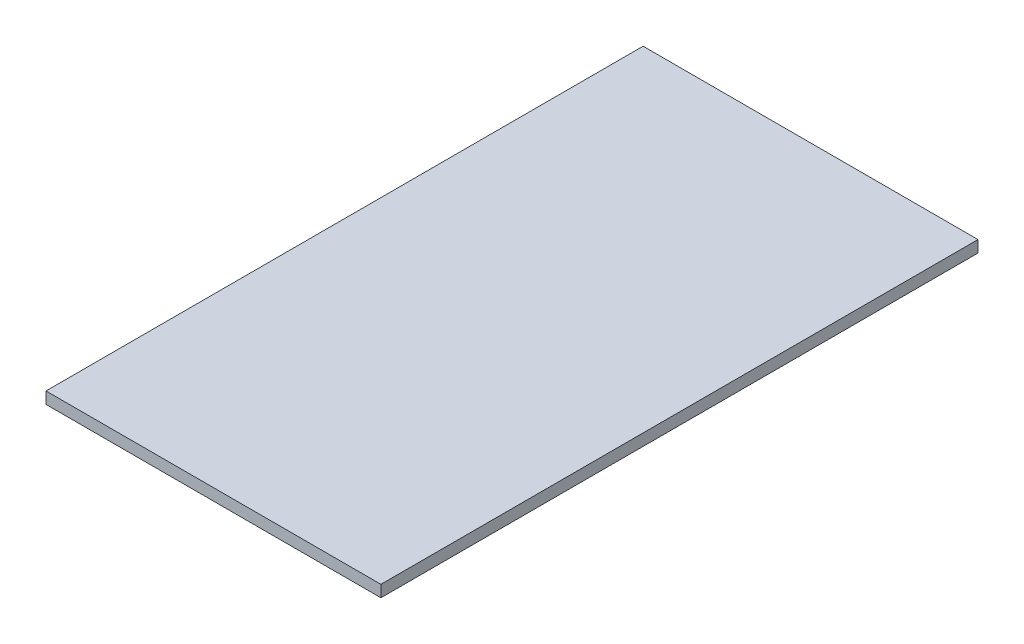
ISO-10303-21;
HEADER;
FILE_DESCRIPTION(('STEP AP214'),'2;1');
FILE_NAME('part.step','',(''),(''),'','','');
FILE_SCHEMA(('AUTOMOTIVE_DESIGN { 1 0 10303 214 1 1 1 1 }'));
ENDSEC;
DATA;
#1=APPLICATION_CONTEXT('core data for automotive mechanical design processes');
#2=APPLICATION_PROTOCOL_DEFINITION('international standard','automotive_design',2000,#1);
#3=PRODUCT_CONTEXT('',#1,'mechanical');
#4=PRODUCT('Part','Part','',(#3));
#5=PRODUCT_RELATED_PRODUCT_CATEGORY('part','',(#4));
#6=PRODUCT_DEFINITION_FORMATION('','',#4);
#7=PRODUCT_DEFINITION_CONTEXT('part definition',#1,'design');
#8=PRODUCT_DEFINITION('design','',#6,#7);
#9=PRODUCT_DEFINITION_SHAPE('','',#8);
#10=(LENGTH_UNIT() NAMED_UNIT(*) SI_UNIT(.MILLI.,.METRE.));
#11=(NAMED_UNIT(*) PLANE_ANGLE_UNIT() SI_UNIT($,.RADIAN.));
#12=(NAMED_UNIT(*) SI_UNIT($,.STERADIAN.) SOLID_ANGLE_UNIT());
#13=UNCERTAINTY_MEASURE_WITH_UNIT(LENGTH_MEASURE(1.E-05),#10,'distance_accuracy_value','');
#14=(GEOMETRIC_REPRESENTATION_CONTEXT(3) GLOBAL_UNCERTAINTY_ASSIGNED_CONTEXT((#13)) GLOBAL_UNIT_ASSIGNED_CONTEXT((#10,
#11,#12)) REPRESENTATION_CONTEXT('',''));
#15=CARTESIAN_POINT('',(0.,0.,0.));
#16=DIRECTION('',(0.,0.,1.));
#17=DIRECTION('',(1.,0.,0.));
#18=AXIS2_PLACEMENT_3D('',#15,#16,#17);
#19=CARTESIAN_POINT('',(-258.,18.,460.));
#20=DIRECTION('',(1.,0.,0.));
#21=DIRECTION('',(0.,0.,-1.));
#22=AXIS2_PLACEMENT_3D('',#19,#20,#21);
#23=PLANE('',#22);
#24=DIRECTION('',(0.,0.,1.));
#25=VECTOR('',#24,1.);
#26=CARTESIAN_POINT('',(-258.,0.,460.));
#27=LINE('',#26,#25);
#28=CARTESIAN_POINT('',(-258.,0.,-460.));
#29=VERTEX_POINT('',#28);
#30=CARTESIAN_POINT('',(-258.,0.,460.));
#31=VERTEX_POINT('',#30);
#32=EDGE_CURVE('E98',#29,#31,#27,.T.);
#33=ORIENTED_EDGE('',*,*,#32,.T.);
#34=DIRECTION('',(0.,-1.,0.));
#35=VECTOR('',#34,1.);
#36=CARTESIAN_POINT('',(-258.,18.,460.));
#37=LINE('',#36,#35);
#38=CARTESIAN_POINT('',(-258.,18.,460.));
#39=VERTEX_POINT('',#38);
#40=EDGE_CURVE('E11',#39,#31,#37,.T.);
#41=ORIENTED_EDGE('',*,*,#40,.F.);
#42=DIRECTION('',(0.,0.,1.));
#43=VECTOR('',#42,1.);
#44=CARTESIAN_POINT('',(-258.,18.,460.));
#45=LINE('',#44,#43);
#46=CARTESIAN_POINT('',(-258.,18.,-460.));
#47=VERTEX_POINT('',#46);
#48=EDGE_CURVE('E86',#47,#39,#45,.T.);
#49=ORIENTED_EDGE('',*,*,#48,.F.);
#50=DIRECTION('',(0.,-1.,0.));
#51=VECTOR('',#50,1.);
#52=CARTESIAN_POINT('',(-258.,18.,-460.));
#53=LINE('',#52,#51);
#54=EDGE_CURVE('E94',#47,#29,#53,.T.);
#55=ORIENTED_EDGE('',*,*,#54,.T.);
#56=EDGE_LOOP('',(#33,#41,#49,#55));
#57=FACE_BOUND('',#56,.T.);
#58=ADVANCED_FACE('F35',(#57),#23,.F.);
#59=CARTESIAN_POINT('',(258.,18.,460.));
#60=DIRECTION('',(0.,0.,-1.));
#61=DIRECTION('',(-1.,0.,0.));
#62=AXIS2_PLACEMENT_3D('',#59,#60,#61);
#63=PLANE('',#62);
#64=DIRECTION('',(1.,0.,0.));
#65=VECTOR('',#64,1.);
#66=CARTESIAN_POINT('',(258.,0.,460.));
#67=LINE('',#66,#65);
#68=CARTESIAN_POINT('',(258.,0.,460.));
#69=VERTEX_POINT('',#68);
#70=EDGE_CURVE('E90',#31,#69,#67,.T.);
#71=ORIENTED_EDGE('',*,*,#70,.T.);
#72=DIRECTION('',(0.,-1.,0.));
#73=VECTOR('',#72,1.);
#74=CARTESIAN_POINT('',(258.,18.,460.));
#75=LINE('',#74,#73);
#76=CARTESIAN_POINT('',(258.,18.,460.));
#77=VERTEX_POINT('',#76);
#78=EDGE_CURVE('E43',#77,#69,#75,.T.);
#79=ORIENTED_EDGE('',*,*,#78,.F.);
#80=DIRECTION('',(1.,0.,0.));
#81=VECTOR('',#80,1.);
#82=CARTESIAN_POINT('',(258.,18.,460.));
#83=LINE('',#82,#81);
#84=EDGE_CURVE('E81',#39,#77,#83,.T.);
#85=ORIENTED_EDGE('',*,*,#84,.F.);
#86=ORIENTED_EDGE('',*,*,#40,.T.);
#87=EDGE_LOOP('',(#71,#79,#85,#86));
#88=FACE_BOUND('',#87,.T.);
#89=ADVANCED_FACE('F89',(#88),#63,.F.);
#90=CARTESIAN_POINT('',(258.,18.,460.));
#91=DIRECTION('',(-1.,0.,0.));
#92=DIRECTION('',(0.,0.,1.));
#93=AXIS2_PLACEMENT_3D('',#90,#91,#92);
#94=PLANE('',#93);
#95=DIRECTION('',(0.,0.,-1.));
#96=VECTOR('',#95,1.);
#97=CARTESIAN_POINT('',(258.,0.,460.));
#98=LINE('',#97,#96);
#99=CARTESIAN_POINT('',(258.,0.,-460.));
#100=VERTEX_POINT('',#99);
#101=EDGE_CURVE('E68',#69,#100,#98,.T.);
#102=ORIENTED_EDGE('',*,*,#101,.T.);
#103=DIRECTION('',(0.,-1.,0.));
#104=VECTOR('',#103,1.);
#105=CARTESIAN_POINT('',(258.,18.,-460.));
#106=LINE('',#105,#104);
#107=CARTESIAN_POINT('',(258.,18.,-460.));
#108=VERTEX_POINT('',#107);
#109=EDGE_CURVE('E91',#108,#100,#106,.T.);
#110=ORIENTED_EDGE('',*,*,#109,.F.);
#111=DIRECTION('',(0.,0.,-1.));
#112=VECTOR('',#111,1.);
#113=CARTESIAN_POINT('',(258.,18.,460.));
#114=LINE('',#113,#112);
#115=EDGE_CURVE('E84',#77,#108,#114,.T.);
#116=ORIENTED_EDGE('',*,*,#115,.F.);
#117=ORIENTED_EDGE('',*,*,#78,.T.);
#118=EDGE_LOOP('',(#102,#110,#116,#117));
#119=FACE_BOUND('',#118,.T.);
#120=ADVANCED_FACE('F92',(#119),#94,.F.);
#121=CARTESIAN_POINT('',(258.,18.,-460.));
#122=DIRECTION('',(0.,0.,1.));
#123=DIRECTION('',(1.,0.,0.));
#124=AXIS2_PLACEMENT_3D('',#121,#122,#123);
#125=PLANE('',#124);
#126=DIRECTION('',(-1.,0.,0.));
#127=VECTOR('',#126,1.);
#128=CARTESIAN_POINT('',(258.,0.,-460.));
#129=LINE('',#128,#127);
#130=EDGE_CURVE('E74',#100,#29,#129,.T.);
#131=ORIENTED_EDGE('',*,*,#130,.T.);
#132=ORIENTED_EDGE('',*,*,#54,.F.);
#133=DIRECTION('',(-1.,0.,0.));
#134=VECTOR('',#133,1.);
#135=CARTESIAN_POINT('',(258.,18.,-460.));
#136=LINE('',#135,#134);
#137=EDGE_CURVE('E51',#108,#47,#136,.T.);
#138=ORIENTED_EDGE('',*,*,#137,.F.);
#139=ORIENTED_EDGE('',*,*,#109,.T.);
#140=EDGE_LOOP('',(#131,#132,#138,#139));
#141=FACE_BOUND('',#140,.T.);
#142=ADVANCED_FACE('F105',(#141),#125,.F.);
#143=CARTESIAN_POINT('',(0.,18.,0.));
#144=DIRECTION('',(0.,1.,0.));
#145=DIRECTION('',(0.,0.,1.));
#146=AXIS2_PLACEMENT_3D('',#143,#144,#145);
#147=PLANE('',#146);
#148=ORIENTED_EDGE('',*,*,#48,.T.);
#149=ORIENTED_EDGE('',*,*,#84,.T.);
#150=ORIENTED_EDGE('',*,*,#115,.T.);
#151=ORIENTED_EDGE('',*,*,#137,.T.);
#152=EDGE_LOOP('',(#148,#149,#150,#151));
#153=FACE_BOUND('',#152,.T.);
#154=ADVANCED_FACE('F82',(#153),#147,.T.);
#155=CARTESIAN_POINT('',(0.,0.,0.));
#156=DIRECTION('',(0.,1.,0.));
#157=DIRECTION('',(0.,0.,1.));
#158=AXIS2_PLACEMENT_3D('',#155,#156,#157);
#159=PLANE('',#158);
#160=ORIENTED_EDGE('',*,*,#32,.F.);
#161=ORIENTED_EDGE('',*,*,#130,.F.);
#162=ORIENTED_EDGE('',*,*,#101,.F.);
#163=ORIENTED_EDGE('',*,*,#70,.F.);
#164=EDGE_LOOP('',(#160,#161,#162,#163));
#165=FACE_BOUND('',#164,.T.);
#166=ADVANCED_FACE('F108',(#165),#159,.F.);
#167=CLOSED_SHELL('',(#58,#89,#120,#142,#154,#166));
#168=MANIFOLD_SOLID_BREP('B2',#167);
#169=ADVANCED_BREP_SHAPE_REPRESENTATION('',(#18,#168),#14);
#170=SHAPE_DEFINITION_REPRESENTATION(#9,#169);
ENDSEC;
END-ISO-10303-21;
